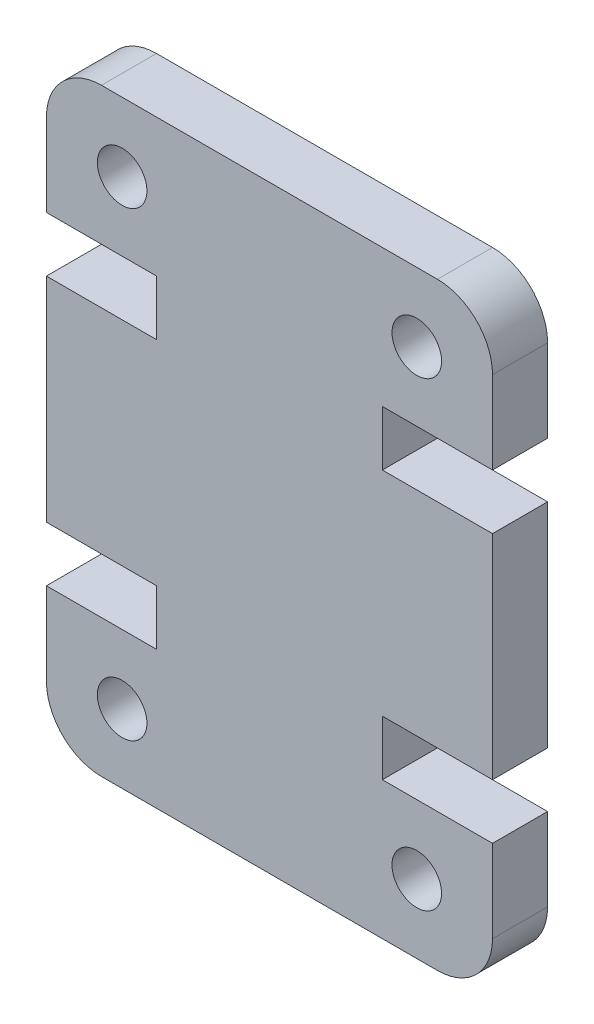
ISO-10303-21;
HEADER;
FILE_DESCRIPTION(('STEP AP214'),'2;1');
FILE_NAME('part.step','',(''),(''),'','','');
FILE_SCHEMA(('AUTOMOTIVE_DESIGN { 1 0 10303 214 1 1 1 1 }'));
ENDSEC;
DATA;
#1=APPLICATION_CONTEXT('core data for automotive mechanical design processes');
#2=APPLICATION_PROTOCOL_DEFINITION('international standard','automotive_design',2000,#1);
#3=PRODUCT_CONTEXT('',#1,'mechanical');
#4=PRODUCT('Part','Part','',(#3));
#5=PRODUCT_RELATED_PRODUCT_CATEGORY('part','',(#4));
#6=PRODUCT_DEFINITION_FORMATION('','',#4);
#7=PRODUCT_DEFINITION_CONTEXT('part definition',#1,'design');
#8=PRODUCT_DEFINITION('design','',#6,#7);
#9=PRODUCT_DEFINITION_SHAPE('','',#8);
#10=(LENGTH_UNIT() NAMED_UNIT(*) SI_UNIT(.MILLI.,.METRE.));
#11=(NAMED_UNIT(*) PLANE_ANGLE_UNIT() SI_UNIT($,.RADIAN.));
#12=(NAMED_UNIT(*) SI_UNIT($,.STERADIAN.) SOLID_ANGLE_UNIT());
#13=UNCERTAINTY_MEASURE_WITH_UNIT(LENGTH_MEASURE(1.E-05),#10,'distance_accuracy_value','');
#14=(GEOMETRIC_REPRESENTATION_CONTEXT(3) GLOBAL_UNCERTAINTY_ASSIGNED_CONTEXT((#13)) GLOBAL_UNIT_ASSIGNED_CONTEXT((#10,
#11,#12)) REPRESENTATION_CONTEXT('',''));
#15=CARTESIAN_POINT('',(0.,0.,0.));
#16=DIRECTION('',(0.,0.,1.));
#17=DIRECTION('',(1.,0.,0.));
#18=AXIS2_PLACEMENT_3D('',#15,#16,#17);
#19=CARTESIAN_POINT('',(14.2,2.,4.));
#20=DIRECTION('',(0.,0.,-1.));
#21=DIRECTION('',(-1.,0.,0.));
#22=AXIS2_PLACEMENT_3D('',#19,#20,#21);
#23=PLANE('',#22);
#24=CARTESIAN_POINT('',(2.75000000000004,19.2399999999998,4.));
#25=DIRECTION('',(0.,0.,1.));
#26=DIRECTION('',(-1.,0.,0.));
#27=AXIS2_PLACEMENT_3D('',#24,#25,#26);
#28=CIRCLE('',#27,0.9);
#29=CARTESIAN_POINT('',(1.85000000000004,19.2399999999998,4.));
#30=VERTEX_POINT('',#29);
#31=EDGE_CURVE('E356',#30,#30,#28,.T.);
#32=ORIENTED_EDGE('',*,*,#31,.F.);
#33=EDGE_LOOP('',(#32));
#34=FACE_BOUND('',#33,.T.);
#35=CARTESIAN_POINT('',(13.45,2.50000000000017,4.));
#36=DIRECTION('',(0.,0.,1.));
#37=DIRECTION('',(-1.,0.,0.));
#38=AXIS2_PLACEMENT_3D('',#35,#36,#37);
#39=CIRCLE('',#38,0.9);
#40=CARTESIAN_POINT('',(12.55,2.50000000000017,4.));
#41=VERTEX_POINT('',#40);
#42=EDGE_CURVE('E362',#41,#41,#39,.T.);
#43=ORIENTED_EDGE('',*,*,#42,.F.);
#44=EDGE_LOOP('',(#43));
#45=FACE_BOUND('',#44,.T.);
#46=CARTESIAN_POINT('',(14.2,2.,4.));
#47=DIRECTION('',(0.,0.,1.));
#48=DIRECTION('',(-1.,0.,0.));
#49=AXIS2_PLACEMENT_3D('',#46,#47,#48);
#50=CIRCLE('',#49,2.);
#51=CARTESIAN_POINT('',(14.2,0.,4.));
#52=VERTEX_POINT('',#51);
#53=CARTESIAN_POINT('',(16.2,2.,4.));
#54=VERTEX_POINT('',#53);
#55=EDGE_CURVE('E365',#52,#54,#50,.T.);
#56=ORIENTED_EDGE('',*,*,#55,.T.);
#57=DIRECTION('',(0.,1.,0.));
#58=VECTOR('',#57,1.);
#59=CARTESIAN_POINT('',(16.2,2.,4.));
#60=LINE('',#59,#58);
#61=CARTESIAN_POINT('',(16.2,4.99999999999945,4.));
#62=VERTEX_POINT('',#61);
#63=EDGE_CURVE('E295',#54,#62,#60,.T.);
#64=ORIENTED_EDGE('',*,*,#63,.T.);
#65=DIRECTION('',(-1.,0.,0.));
#66=VECTOR('',#65,1.);
#67=CARTESIAN_POINT('',(12.2,4.99999999999945,4.));
#68=LINE('',#67,#66);
#69=CARTESIAN_POINT('',(12.2,4.99999999999945,4.));
#70=VERTEX_POINT('',#69);
#71=EDGE_CURVE('E291',#62,#70,#68,.T.);
#72=ORIENTED_EDGE('',*,*,#71,.T.);
#73=DIRECTION('',(0.,1.,0.));
#74=VECTOR('',#73,1.);
#75=CARTESIAN_POINT('',(12.2,6.99999999999945,4.));
#76=LINE('',#75,#74);
#77=CARTESIAN_POINT('',(12.2,6.99999999999945,4.));
#78=VERTEX_POINT('',#77);
#79=EDGE_CURVE('E369',#70,#78,#76,.T.);
#80=ORIENTED_EDGE('',*,*,#79,.T.);
#81=DIRECTION('',(1.,0.,0.));
#82=VECTOR('',#81,1.);
#83=CARTESIAN_POINT('',(16.2,6.99999999999945,4.));
#84=LINE('',#83,#82);
#85=CARTESIAN_POINT('',(16.2,6.99999999999945,4.));
#86=VERTEX_POINT('',#85);
#87=EDGE_CURVE('E371',#78,#86,#84,.T.);
#88=ORIENTED_EDGE('',*,*,#87,.T.);
#89=DIRECTION('',(0.,1.,0.));
#90=VECTOR('',#89,1.);
#91=CARTESIAN_POINT('',(16.2,14.7400000000005,4.));
#92=LINE('',#91,#90);
#93=CARTESIAN_POINT('',(16.2,14.7400000000005,4.));
#94=VERTEX_POINT('',#93);
#95=EDGE_CURVE('E373',#86,#94,#92,.T.);
#96=ORIENTED_EDGE('',*,*,#95,.T.);
#97=DIRECTION('',(-1.,0.,0.));
#98=VECTOR('',#97,1.);
#99=CARTESIAN_POINT('',(16.2,14.7400000000005,4.));
#100=LINE('',#99,#98);
#101=CARTESIAN_POINT('',(12.2,14.7400000000005,4.));
#102=VERTEX_POINT('',#101);
#103=EDGE_CURVE('E375',#94,#102,#100,.T.);
#104=ORIENTED_EDGE('',*,*,#103,.T.);
#105=DIRECTION('',(0.,1.,0.));
#106=VECTOR('',#105,1.);
#107=CARTESIAN_POINT('',(12.2,14.7400000000005,4.));
#108=LINE('',#107,#106);
#109=CARTESIAN_POINT('',(12.2,16.7400000000005,4.));
#110=VERTEX_POINT('',#109);
#111=EDGE_CURVE('E377',#102,#110,#108,.T.);
#112=ORIENTED_EDGE('',*,*,#111,.T.);
#113=DIRECTION('',(1.,0.,0.));
#114=VECTOR('',#113,1.);
#115=CARTESIAN_POINT('',(12.2,16.7400000000005,4.));
#116=LINE('',#115,#114);
#117=CARTESIAN_POINT('',(16.2,16.7400000000005,4.));
#118=VERTEX_POINT('',#117);
#119=EDGE_CURVE('E379',#110,#118,#116,.T.);
#120=ORIENTED_EDGE('',*,*,#119,.T.);
#121=DIRECTION('',(0.,1.,0.));
#122=VECTOR('',#121,1.);
#123=CARTESIAN_POINT('',(16.2,19.74,4.));
#124=LINE('',#123,#122);
#125=CARTESIAN_POINT('',(16.2,19.74,4.));
#126=VERTEX_POINT('',#125);
#127=EDGE_CURVE('E381',#118,#126,#124,.T.);
#128=ORIENTED_EDGE('',*,*,#127,.T.);
#129=CARTESIAN_POINT('',(14.2,19.74,4.));
#130=DIRECTION('',(0.,0.,1.));
#131=DIRECTION('',(1.,0.,0.));
#132=AXIS2_PLACEMENT_3D('',#129,#130,#131);
#133=CIRCLE('',#132,2.);
#134=CARTESIAN_POINT('',(14.2,21.74,4.));
#135=VERTEX_POINT('',#134);
#136=EDGE_CURVE('E383',#126,#135,#133,.T.);
#137=ORIENTED_EDGE('',*,*,#136,.T.);
#138=DIRECTION('',(-1.,0.,0.));
#139=VECTOR('',#138,1.);
#140=CARTESIAN_POINT('',(1.99999999999999,21.74,4.));
#141=LINE('',#140,#139);
#142=CARTESIAN_POINT('',(1.99999999999999,21.74,4.));
#143=VERTEX_POINT('',#142);
#144=EDGE_CURVE('E385',#135,#143,#141,.T.);
#145=ORIENTED_EDGE('',*,*,#144,.T.);
#146=CARTESIAN_POINT('',(2.,19.74,4.));
#147=DIRECTION('',(0.,0.,1.));
#148=DIRECTION('',(-1.,0.,0.));
#149=AXIS2_PLACEMENT_3D('',#146,#147,#148);
#150=CIRCLE('',#149,2.);
#151=CARTESIAN_POINT('',(0.,19.74,4.));
#152=VERTEX_POINT('',#151);
#153=EDGE_CURVE('E387',#143,#152,#150,.T.);
#154=ORIENTED_EDGE('',*,*,#153,.T.);
#155=DIRECTION('',(0.,-1.,0.));
#156=VECTOR('',#155,1.);
#157=CARTESIAN_POINT('',(0.,19.74,4.));
#158=LINE('',#157,#156);
#159=CARTESIAN_POINT('',(0.,16.7400000000005,4.));
#160=VERTEX_POINT('',#159);
#161=EDGE_CURVE('E389',#152,#160,#158,.T.);
#162=ORIENTED_EDGE('',*,*,#161,.T.);
#163=DIRECTION('',(1.,0.,0.));
#164=VECTOR('',#163,1.);
#165=CARTESIAN_POINT('',(4.,16.7400000000005,4.));
#166=LINE('',#165,#164);
#167=CARTESIAN_POINT('',(4.,16.7400000000005,4.));
#168=VERTEX_POINT('',#167);
#169=EDGE_CURVE('E391',#160,#168,#166,.T.);
#170=ORIENTED_EDGE('',*,*,#169,.T.);
#171=DIRECTION('',(0.,-1.,0.));
#172=VECTOR('',#171,1.);
#173=CARTESIAN_POINT('',(4.,14.7400000000005,4.));
#174=LINE('',#173,#172);
#175=CARTESIAN_POINT('',(4.,14.7400000000005,4.));
#176=VERTEX_POINT('',#175);
#177=EDGE_CURVE('E393',#168,#176,#174,.T.);
#178=ORIENTED_EDGE('',*,*,#177,.T.);
#179=DIRECTION('',(-1.,0.,0.));
#180=VECTOR('',#179,1.);
#181=CARTESIAN_POINT('',(0.,14.7400000000005,4.));
#182=LINE('',#181,#180);
#183=CARTESIAN_POINT('',(0.,14.7400000000005,4.));
#184=VERTEX_POINT('',#183);
#185=EDGE_CURVE('E395',#176,#184,#182,.T.);
#186=ORIENTED_EDGE('',*,*,#185,.T.);
#187=DIRECTION('',(0.,-1.,0.));
#188=VECTOR('',#187,1.);
#189=CARTESIAN_POINT('',(0.,14.7400000000005,4.));
#190=LINE('',#189,#188);
#191=CARTESIAN_POINT('',(0.,6.99999999999946,4.));
#192=VERTEX_POINT('',#191);
#193=EDGE_CURVE('E397',#184,#192,#190,.T.);
#194=ORIENTED_EDGE('',*,*,#193,.T.);
#195=DIRECTION('',(1.,0.,0.));
#196=VECTOR('',#195,1.);
#197=CARTESIAN_POINT('',(0.,6.99999999999946,4.));
#198=LINE('',#197,#196);
#199=CARTESIAN_POINT('',(4.00000000000002,6.99999999999946,4.));
#200=VERTEX_POINT('',#199);
#201=EDGE_CURVE('E399',#192,#200,#198,.T.);
#202=ORIENTED_EDGE('',*,*,#201,.T.);
#203=DIRECTION('',(0.,-1.,0.));
#204=VECTOR('',#203,1.);
#205=CARTESIAN_POINT('',(4.00000000000002,6.99999999999946,4.));
#206=LINE('',#205,#204);
#207=CARTESIAN_POINT('',(4.,4.99999999999945,4.));
#208=VERTEX_POINT('',#207);
#209=EDGE_CURVE('E401',#200,#208,#206,.T.);
#210=ORIENTED_EDGE('',*,*,#209,.T.);
#211=DIRECTION('',(-1.,0.,0.));
#212=VECTOR('',#211,1.);
#213=CARTESIAN_POINT('',(4.,4.99999999999945,4.));
#214=LINE('',#213,#212);
#215=CARTESIAN_POINT('',(0.,4.99999999999945,4.));
#216=VERTEX_POINT('',#215);
#217=EDGE_CURVE('E403',#208,#216,#214,.T.);
#218=ORIENTED_EDGE('',*,*,#217,.T.);
#219=DIRECTION('',(0.,-1.,0.));
#220=VECTOR('',#219,1.);
#221=CARTESIAN_POINT('',(0.,2.,4.));
#222=LINE('',#221,#220);
#223=CARTESIAN_POINT('',(0.,2.,4.));
#224=VERTEX_POINT('',#223);
#225=EDGE_CURVE('E405',#216,#224,#222,.T.);
#226=ORIENTED_EDGE('',*,*,#225,.T.);
#227=CARTESIAN_POINT('',(2.00000000000002,2.,4.));
#228=DIRECTION('',(0.,0.,1.));
#229=DIRECTION('',(1.,0.,0.));
#230=AXIS2_PLACEMENT_3D('',#227,#228,#229);
#231=CIRCLE('',#230,2.00000000000001);
#232=CARTESIAN_POINT('',(2.00000000000002,0.,4.));
#233=VERTEX_POINT('',#232);
#234=EDGE_CURVE('E221',#224,#233,#231,.T.);
#235=ORIENTED_EDGE('',*,*,#234,.T.);
#236=DIRECTION('',(1.,0.,0.));
#237=VECTOR('',#236,1.);
#238=CARTESIAN_POINT('',(2.00000000000002,0.,4.));
#239=LINE('',#238,#237);
#240=EDGE_CURVE('E57',#233,#52,#239,.T.);
#241=ORIENTED_EDGE('',*,*,#240,.T.);
#242=EDGE_LOOP('',(#56,#64,#72,#80,#88,#96,#104,#112,#120,#128,#137,#145,#154,#162,#170,#178,
#186,#194,#202,#210,#218,#226,#235,#241));
#243=FACE_BOUND('',#242,.T.);
#244=CARTESIAN_POINT('',(2.75000000000004,2.50000000000017,4.));
#245=DIRECTION('',(0.,0.,1.));
#246=DIRECTION('',(1.,0.,0.));
#247=AXIS2_PLACEMENT_3D('',#244,#245,#246);
#248=CIRCLE('',#247,0.9);
#249=CARTESIAN_POINT('',(3.65000000000004,2.50000000000017,4.));
#250=VERTEX_POINT('',#249);
#251=EDGE_CURVE('E359',#250,#250,#248,.T.);
#252=ORIENTED_EDGE('',*,*,#251,.F.);
#253=EDGE_LOOP('',(#252));
#254=FACE_BOUND('',#253,.T.);
#255=CARTESIAN_POINT('',(13.45,19.2399999999998,4.));
#256=DIRECTION('',(0.,0.,1.));
#257=DIRECTION('',(1.,0.,0.));
#258=AXIS2_PLACEMENT_3D('',#255,#256,#257);
#259=CIRCLE('',#258,0.900000000000001);
#260=CARTESIAN_POINT('',(14.35,19.2399999999998,4.));
#261=VERTEX_POINT('',#260);
#262=EDGE_CURVE('E353',#261,#261,#259,.T.);
#263=ORIENTED_EDGE('',*,*,#262,.F.);
#264=EDGE_LOOP('',(#263));
#265=FACE_BOUND('',#264,.T.);
#266=ADVANCED_FACE('F33',(#34,#45,#243,#254,#265),#23,.F.);
#267=CARTESIAN_POINT('',(14.2,2.,4.));
#268=DIRECTION('',(0.,0.,-1.));
#269=DIRECTION('',(-1.,0.,0.));
#270=AXIS2_PLACEMENT_3D('',#267,#268,#269);
#271=CYLINDRICAL_SURFACE('',#270,2.);
#272=DIRECTION('',(0.,0.,-1.));
#273=VECTOR('',#272,1.);
#274=CARTESIAN_POINT('',(14.2,0.,4.));
#275=LINE('',#274,#273);
#276=CARTESIAN_POINT('',(14.2,0.,2.));
#277=VERTEX_POINT('',#276);
#278=EDGE_CURVE('E226',#52,#277,#275,.T.);
#279=ORIENTED_EDGE('',*,*,#278,.T.);
#280=CARTESIAN_POINT('',(14.2,2.,2.));
#281=DIRECTION('',(0.,0.,1.));
#282=DIRECTION('',(1.,0.,0.));
#283=AXIS2_PLACEMENT_3D('',#280,#281,#282);
#284=CIRCLE('',#283,2.);
#285=CARTESIAN_POINT('',(16.2,2.,2.));
#286=VERTEX_POINT('',#285);
#287=EDGE_CURVE('E49',#277,#286,#284,.T.);
#288=ORIENTED_EDGE('',*,*,#287,.T.);
#289=DIRECTION('',(0.,0.,-1.));
#290=VECTOR('',#289,1.);
#291=CARTESIAN_POINT('',(16.2,2.,4.));
#292=LINE('',#291,#290);
#293=EDGE_CURVE('E11',#54,#286,#292,.T.);
#294=ORIENTED_EDGE('',*,*,#293,.F.);
#295=ORIENTED_EDGE('',*,*,#55,.F.);
#296=EDGE_LOOP('',(#279,#288,#294,#295));
#297=FACE_BOUND('',#296,.T.);
#298=ADVANCED_FACE('F35',(#297),#271,.T.);
#299=CARTESIAN_POINT('',(16.2,2.,4.));
#300=DIRECTION('',(-1.,0.,0.));
#301=DIRECTION('',(0.,-1.,0.));
#302=AXIS2_PLACEMENT_3D('',#299,#300,#301);
#303=PLANE('',#302);
#304=ORIENTED_EDGE('',*,*,#293,.T.);
#305=DIRECTION('',(0.,-1.,0.));
#306=VECTOR('',#305,1.);
#307=CARTESIAN_POINT('',(16.2,0.,2.));
#308=LINE('',#307,#306);
#309=CARTESIAN_POINT('',(16.2,4.99999999999945,2.));
#310=VERTEX_POINT('',#309);
#311=EDGE_CURVE('E296',#310,#286,#308,.T.);
#312=ORIENTED_EDGE('',*,*,#311,.F.);
#313=DIRECTION('',(0.,0.,-1.));
#314=VECTOR('',#313,1.);
#315=CARTESIAN_POINT('',(16.2,4.99999999999945,4.));
#316=LINE('',#315,#314);
#317=EDGE_CURVE('E42',#62,#310,#316,.T.);
#318=ORIENTED_EDGE('',*,*,#317,.F.);
#319=ORIENTED_EDGE('',*,*,#63,.F.);
#320=EDGE_LOOP('',(#304,#312,#318,#319));
#321=FACE_BOUND('',#320,.T.);
#322=ADVANCED_FACE('F294',(#321),#303,.F.);
#323=CARTESIAN_POINT('',(12.2,4.99999999999945,4.));
#324=DIRECTION('',(0.,-1.,0.));
#325=DIRECTION('',(0.,0.,-1.));
#326=AXIS2_PLACEMENT_3D('',#323,#324,#325);
#327=PLANE('',#326);
#328=ORIENTED_EDGE('',*,*,#317,.T.);
#329=DIRECTION('',(-1.,0.,0.));
#330=VECTOR('',#329,1.);
#331=CARTESIAN_POINT('',(12.2,4.99999999999945,2.));
#332=LINE('',#331,#330);
#333=CARTESIAN_POINT('',(12.2,4.99999999999945,2.));
#334=VERTEX_POINT('',#333);
#335=EDGE_CURVE('E290',#310,#334,#332,.T.);
#336=ORIENTED_EDGE('',*,*,#335,.T.);
#337=DIRECTION('',(0.,0.,-1.));
#338=VECTOR('',#337,1.);
#339=CARTESIAN_POINT('',(12.2,4.99999999999945,4.));
#340=LINE('',#339,#338);
#341=EDGE_CURVE('E280',#70,#334,#340,.T.);
#342=ORIENTED_EDGE('',*,*,#341,.F.);
#343=ORIENTED_EDGE('',*,*,#71,.F.);
#344=EDGE_LOOP('',(#328,#336,#342,#343));
#345=FACE_BOUND('',#344,.T.);
#346=ADVANCED_FACE('F288',(#345),#327,.F.);
#347=CARTESIAN_POINT('',(12.2,6.99999999999945,4.));
#348=DIRECTION('',(-1.,0.,0.));
#349=DIRECTION('',(0.,0.,1.));
#350=AXIS2_PLACEMENT_3D('',#347,#348,#349);
#351=PLANE('',#350);
#352=ORIENTED_EDGE('',*,*,#341,.T.);
#353=DIRECTION('',(0.,1.,0.));
#354=VECTOR('',#353,1.);
#355=CARTESIAN_POINT('',(12.2,6.99999999999945,2.));
#356=LINE('',#355,#354);
#357=CARTESIAN_POINT('',(12.2,6.99999999999945,2.));
#358=VERTEX_POINT('',#357);
#359=EDGE_CURVE('E348',#334,#358,#356,.T.);
#360=ORIENTED_EDGE('',*,*,#359,.T.);
#361=DIRECTION('',(0.,0.,-1.));
#362=VECTOR('',#361,1.);
#363=CARTESIAN_POINT('',(12.2,6.99999999999945,4.));
#364=LINE('',#363,#362);
#365=EDGE_CURVE('E277',#78,#358,#364,.T.);
#366=ORIENTED_EDGE('',*,*,#365,.F.);
#367=ORIENTED_EDGE('',*,*,#79,.F.);
#368=EDGE_LOOP('',(#352,#360,#366,#367));
#369=FACE_BOUND('',#368,.T.);
#370=ADVANCED_FACE('F467',(#369),#351,.F.);
#371=CARTESIAN_POINT('',(16.2,6.99999999999945,4.));
#372=DIRECTION('',(0.,1.,0.));
#373=DIRECTION('',(-1.,0.,0.));
#374=AXIS2_PLACEMENT_3D('',#371,#372,#373);
#375=PLANE('',#374);
#376=ORIENTED_EDGE('',*,*,#365,.T.);
#377=DIRECTION('',(1.,0.,0.));
#378=VECTOR('',#377,1.);
#379=CARTESIAN_POINT('',(16.2,6.99999999999945,2.));
#380=LINE('',#379,#378);
#381=CARTESIAN_POINT('',(16.2,6.99999999999945,2.));
#382=VERTEX_POINT('',#381);
#383=EDGE_CURVE('E345',#358,#382,#380,.T.);
#384=ORIENTED_EDGE('',*,*,#383,.T.);
#385=DIRECTION('',(0.,0.,-1.));
#386=VECTOR('',#385,1.);
#387=CARTESIAN_POINT('',(16.2,6.99999999999945,4.));
#388=LINE('',#387,#386);
#389=EDGE_CURVE('E274',#86,#382,#388,.T.);
#390=ORIENTED_EDGE('',*,*,#389,.F.);
#391=ORIENTED_EDGE('',*,*,#87,.F.);
#392=EDGE_LOOP('',(#376,#384,#390,#391));
#393=FACE_BOUND('',#392,.T.);
#394=ADVANCED_FACE('F471',(#393),#375,.F.);
#395=CARTESIAN_POINT('',(16.2,14.7400000000005,4.));
#396=DIRECTION('',(-1.,0.,0.));
#397=DIRECTION('',(0.,0.,1.));
#398=AXIS2_PLACEMENT_3D('',#395,#396,#397);
#399=PLANE('',#398);
#400=ORIENTED_EDGE('',*,*,#389,.T.);
#401=CARTESIAN_POINT('',(16.2,14.7400000000005,2.));
#402=VERTEX_POINT('',#401);
#403=EDGE_CURVE('E298',#402,#382,#308,.T.);
#404=ORIENTED_EDGE('',*,*,#403,.F.);
#405=DIRECTION('',(0.,0.,-1.));
#406=VECTOR('',#405,1.);
#407=CARTESIAN_POINT('',(16.2,14.7400000000005,4.));
#408=LINE('',#407,#406);
#409=EDGE_CURVE('E271',#94,#402,#408,.T.);
#410=ORIENTED_EDGE('',*,*,#409,.F.);
#411=ORIENTED_EDGE('',*,*,#95,.F.);
#412=EDGE_LOOP('',(#400,#404,#410,#411));
#413=FACE_BOUND('',#412,.T.);
#414=ADVANCED_FACE('F478',(#413),#399,.F.);
#415=CARTESIAN_POINT('',(16.2,14.7400000000005,4.));
#416=DIRECTION('',(0.,-1.,0.));
#417=DIRECTION('',(1.,0.,0.));
#418=AXIS2_PLACEMENT_3D('',#415,#416,#417);
#419=PLANE('',#418);
#420=ORIENTED_EDGE('',*,*,#409,.T.);
#421=DIRECTION('',(-1.,0.,0.));
#422=VECTOR('',#421,1.);
#423=CARTESIAN_POINT('',(16.2,14.7400000000005,2.));
#424=LINE('',#423,#422);
#425=CARTESIAN_POINT('',(12.2,14.7400000000005,2.));
#426=VERTEX_POINT('',#425);
#427=EDGE_CURVE('E342',#402,#426,#424,.T.);
#428=ORIENTED_EDGE('',*,*,#427,.T.);
#429=DIRECTION('',(0.,0.,-1.));
#430=VECTOR('',#429,1.);
#431=CARTESIAN_POINT('',(12.2,14.7400000000005,4.));
#432=LINE('',#431,#430);
#433=EDGE_CURVE('E268',#102,#426,#432,.T.);
#434=ORIENTED_EDGE('',*,*,#433,.F.);
#435=ORIENTED_EDGE('',*,*,#103,.F.);
#436=EDGE_LOOP('',(#420,#428,#434,#435));
#437=FACE_BOUND('',#436,.T.);
#438=ADVANCED_FACE('F480',(#437),#419,.F.);
#439=CARTESIAN_POINT('',(12.2,14.7400000000005,4.));
#440=DIRECTION('',(-1.,0.,0.));
#441=DIRECTION('',(0.,0.,1.));
#442=AXIS2_PLACEMENT_3D('',#439,#440,#441);
#443=PLANE('',#442);
#444=ORIENTED_EDGE('',*,*,#433,.T.);
#445=DIRECTION('',(0.,1.,0.));
#446=VECTOR('',#445,1.);
#447=CARTESIAN_POINT('',(12.2,14.7400000000005,2.));
#448=LINE('',#447,#446);
#449=CARTESIAN_POINT('',(12.2,16.7400000000005,2.));
#450=VERTEX_POINT('',#449);
#451=EDGE_CURVE('E339',#426,#450,#448,.T.);
#452=ORIENTED_EDGE('',*,*,#451,.T.);
#453=DIRECTION('',(0.,0.,-1.));
#454=VECTOR('',#453,1.);
#455=CARTESIAN_POINT('',(12.2,16.7400000000005,4.));
#456=LINE('',#455,#454);
#457=EDGE_CURVE('E265',#110,#450,#456,.T.);
#458=ORIENTED_EDGE('',*,*,#457,.F.);
#459=ORIENTED_EDGE('',*,*,#111,.F.);
#460=EDGE_LOOP('',(#444,#452,#458,#459));
#461=FACE_BOUND('',#460,.T.);
#462=ADVANCED_FACE('F484',(#461),#443,.F.);
#463=CARTESIAN_POINT('',(12.2,16.7400000000005,4.));
#464=DIRECTION('',(0.,1.,0.));
#465=DIRECTION('',(0.,0.,1.));
#466=AXIS2_PLACEMENT_3D('',#463,#464,#465);
#467=PLANE('',#466);
#468=ORIENTED_EDGE('',*,*,#457,.T.);
#469=DIRECTION('',(1.,0.,0.));
#470=VECTOR('',#469,1.);
#471=CARTESIAN_POINT('',(12.2,16.7400000000005,2.));
#472=LINE('',#471,#470);
#473=CARTESIAN_POINT('',(16.2,16.7400000000005,2.));
#474=VERTEX_POINT('',#473);
#475=EDGE_CURVE('E337',#450,#474,#472,.T.);
#476=ORIENTED_EDGE('',*,*,#475,.T.);
#477=DIRECTION('',(0.,0.,-1.));
#478=VECTOR('',#477,1.);
#479=CARTESIAN_POINT('',(16.2,16.7400000000005,4.));
#480=LINE('',#479,#478);
#481=EDGE_CURVE('E262',#118,#474,#480,.T.);
#482=ORIENTED_EDGE('',*,*,#481,.F.);
#483=ORIENTED_EDGE('',*,*,#119,.F.);
#484=EDGE_LOOP('',(#468,#476,#482,#483));
#485=FACE_BOUND('',#484,.T.);
#486=ADVANCED_FACE('F490',(#485),#467,.F.);
#487=CARTESIAN_POINT('',(16.2,19.74,4.));
#488=DIRECTION('',(-1.,0.,0.));
#489=DIRECTION('',(0.,-1.,0.));
#490=AXIS2_PLACEMENT_3D('',#487,#488,#489);
#491=PLANE('',#490);
#492=ORIENTED_EDGE('',*,*,#481,.T.);
#493=CARTESIAN_POINT('',(16.2,19.74,2.));
#494=VERTEX_POINT('',#493);
#495=EDGE_CURVE('E300',#494,#474,#308,.T.);
#496=ORIENTED_EDGE('',*,*,#495,.F.);
#497=DIRECTION('',(0.,0.,-1.));
#498=VECTOR('',#497,1.);
#499=CARTESIAN_POINT('',(16.2,19.74,4.));
#500=LINE('',#499,#498);
#501=EDGE_CURVE('E259',#126,#494,#500,.T.);
#502=ORIENTED_EDGE('',*,*,#501,.F.);
#503=ORIENTED_EDGE('',*,*,#127,.F.);
#504=EDGE_LOOP('',(#492,#496,#502,#503));
#505=FACE_BOUND('',#504,.T.);
#506=ADVANCED_FACE('F492',(#505),#491,.F.);
#507=CARTESIAN_POINT('',(14.2,19.74,4.));
#508=DIRECTION('',(0.,0.,-1.));
#509=DIRECTION('',(-1.,0.,0.));
#510=AXIS2_PLACEMENT_3D('',#507,#508,#509);
#511=CYLINDRICAL_SURFACE('',#510,2.);
#512=ORIENTED_EDGE('',*,*,#501,.T.);
#513=CARTESIAN_POINT('',(14.2,19.74,2.));
#514=DIRECTION('',(0.,0.,1.));
#515=DIRECTION('',(1.,0.,0.));
#516=AXIS2_PLACEMENT_3D('',#513,#514,#515);
#517=CIRCLE('',#516,2.);
#518=CARTESIAN_POINT('',(14.2,21.74,2.));
#519=VERTEX_POINT('',#518);
#520=EDGE_CURVE('E334',#494,#519,#517,.T.);
#521=ORIENTED_EDGE('',*,*,#520,.T.);
#522=DIRECTION('',(0.,0.,-1.));
#523=VECTOR('',#522,1.);
#524=CARTESIAN_POINT('',(14.2,21.74,4.));
#525=LINE('',#524,#523);
#526=EDGE_CURVE('E256',#135,#519,#525,.T.);
#527=ORIENTED_EDGE('',*,*,#526,.F.);
#528=ORIENTED_EDGE('',*,*,#136,.F.);
#529=EDGE_LOOP('',(#512,#521,#527,#528));
#530=FACE_BOUND('',#529,.T.);
#531=ADVANCED_FACE('F496',(#530),#511,.T.);
#532=CARTESIAN_POINT('',(1.99999999999999,21.74,4.));
#533=DIRECTION('',(0.,-1.,0.));
#534=DIRECTION('',(0.,0.,-1.));
#535=AXIS2_PLACEMENT_3D('',#532,#533,#534);
#536=PLANE('',#535);
#537=ORIENTED_EDGE('',*,*,#526,.T.);
#538=DIRECTION('',(1.,0.,0.));
#539=VECTOR('',#538,1.);
#540=CARTESIAN_POINT('',(16.2,21.74,2.));
#541=LINE('',#540,#539);
#542=CARTESIAN_POINT('',(2.,21.74,2.));
#543=VERTEX_POINT('',#542);
#544=EDGE_CURVE('E216',#543,#519,#541,.T.);
#545=ORIENTED_EDGE('',*,*,#544,.F.);
#546=DIRECTION('',(0.,0.,-1.));
#547=VECTOR('',#546,1.);
#548=CARTESIAN_POINT('',(1.99999999999999,21.74,4.));
#549=LINE('',#548,#547);
#550=EDGE_CURVE('E253',#143,#543,#549,.T.);
#551=ORIENTED_EDGE('',*,*,#550,.F.);
#552=ORIENTED_EDGE('',*,*,#144,.F.);
#553=EDGE_LOOP('',(#537,#545,#551,#552));
#554=FACE_BOUND('',#553,.T.);
#555=ADVANCED_FACE('F503',(#554),#536,.F.);
#556=CARTESIAN_POINT('',(2.,19.74,4.));
#557=DIRECTION('',(0.,0.,-1.));
#558=DIRECTION('',(-1.,0.,0.));
#559=AXIS2_PLACEMENT_3D('',#556,#557,#558);
#560=CYLINDRICAL_SURFACE('',#559,2.);
#561=ORIENTED_EDGE('',*,*,#550,.T.);
#562=CARTESIAN_POINT('',(2.,19.74,2.));
#563=DIRECTION('',(0.,0.,1.));
#564=DIRECTION('',(1.,0.,0.));
#565=AXIS2_PLACEMENT_3D('',#562,#563,#564);
#566=CIRCLE('',#565,2.);
#567=CARTESIAN_POINT('',(0.,19.74,2.));
#568=VERTEX_POINT('',#567);
#569=EDGE_CURVE('E331',#543,#568,#566,.T.);
#570=ORIENTED_EDGE('',*,*,#569,.T.);
#571=DIRECTION('',(0.,0.,-1.));
#572=VECTOR('',#571,1.);
#573=CARTESIAN_POINT('',(0.,19.74,4.));
#574=LINE('',#573,#572);
#575=EDGE_CURVE('E250',#152,#568,#574,.T.);
#576=ORIENTED_EDGE('',*,*,#575,.F.);
#577=ORIENTED_EDGE('',*,*,#153,.F.);
#578=EDGE_LOOP('',(#561,#570,#576,#577));
#579=FACE_BOUND('',#578,.T.);
#580=ADVANCED_FACE('F505',(#579),#560,.T.);
#581=CARTESIAN_POINT('',(0.,19.74,4.));
#582=DIRECTION('',(1.,0.,0.));
#583=DIRECTION('',(0.,1.,0.));
#584=AXIS2_PLACEMENT_3D('',#581,#582,#583);
#585=PLANE('',#584);
#586=ORIENTED_EDGE('',*,*,#575,.T.);
#587=DIRECTION('',(0.,1.,0.));
#588=VECTOR('',#587,1.);
#589=CARTESIAN_POINT('',(0.,21.74,2.));
#590=LINE('',#589,#588);
#591=CARTESIAN_POINT('',(0.,16.7400000000005,2.));
#592=VERTEX_POINT('',#591);
#593=EDGE_CURVE('E219',#592,#568,#590,.T.);
#594=ORIENTED_EDGE('',*,*,#593,.F.);
#595=DIRECTION('',(0.,0.,-1.));
#596=VECTOR('',#595,1.);
#597=CARTESIAN_POINT('',(0.,16.7400000000005,4.));
#598=LINE('',#597,#596);
#599=EDGE_CURVE('E247',#160,#592,#598,.T.);
#600=ORIENTED_EDGE('',*,*,#599,.F.);
#601=ORIENTED_EDGE('',*,*,#161,.F.);
#602=EDGE_LOOP('',(#586,#594,#600,#601));
#603=FACE_BOUND('',#602,.T.);
#604=ADVANCED_FACE('F510',(#603),#585,.F.);
#605=CARTESIAN_POINT('',(4.,16.7400000000005,4.));
#606=DIRECTION('',(0.,1.,0.));
#607=DIRECTION('',(-1.,0.,0.));
#608=AXIS2_PLACEMENT_3D('',#605,#606,#607);
#609=PLANE('',#608);
#610=ORIENTED_EDGE('',*,*,#599,.T.);
#611=DIRECTION('',(1.,0.,0.));
#612=VECTOR('',#611,1.);
#613=CARTESIAN_POINT('',(4.,16.7400000000005,2.));
#614=LINE('',#613,#612);
#615=CARTESIAN_POINT('',(4.,16.7400000000005,2.));
#616=VERTEX_POINT('',#615);
#617=EDGE_CURVE('E328',#592,#616,#614,.T.);
#618=ORIENTED_EDGE('',*,*,#617,.T.);
#619=DIRECTION('',(0.,0.,-1.));
#620=VECTOR('',#619,1.);
#621=CARTESIAN_POINT('',(4.,16.7400000000005,4.));
#622=LINE('',#621,#620);
#623=EDGE_CURVE('E244',#168,#616,#622,.T.);
#624=ORIENTED_EDGE('',*,*,#623,.F.);
#625=ORIENTED_EDGE('',*,*,#169,.F.);
#626=EDGE_LOOP('',(#610,#618,#624,#625));
#627=FACE_BOUND('',#626,.T.);
#628=ADVANCED_FACE('F516',(#627),#609,.F.);
#629=CARTESIAN_POINT('',(4.,14.7400000000005,4.));
#630=DIRECTION('',(1.,0.,0.));
#631=DIRECTION('',(0.,0.,-1.));
#632=AXIS2_PLACEMENT_3D('',#629,#630,#631);
#633=PLANE('',#632);
#634=ORIENTED_EDGE('',*,*,#623,.T.);
#635=DIRECTION('',(0.,-1.,0.));
#636=VECTOR('',#635,1.);
#637=CARTESIAN_POINT('',(4.,14.7400000000005,2.));
#638=LINE('',#637,#636);
#639=CARTESIAN_POINT('',(4.,14.7400000000005,2.));
#640=VERTEX_POINT('',#639);
#641=EDGE_CURVE('E325',#616,#640,#638,.T.);
#642=ORIENTED_EDGE('',*,*,#641,.T.);
#643=DIRECTION('',(0.,0.,-1.));
#644=VECTOR('',#643,1.);
#645=CARTESIAN_POINT('',(4.,14.7400000000005,4.));
#646=LINE('',#645,#644);
#647=EDGE_CURVE('E241',#176,#640,#646,.T.);
#648=ORIENTED_EDGE('',*,*,#647,.F.);
#649=ORIENTED_EDGE('',*,*,#177,.F.);
#650=EDGE_LOOP('',(#634,#642,#648,#649));
#651=FACE_BOUND('',#650,.T.);
#652=ADVANCED_FACE('F518',(#651),#633,.F.);
#653=CARTESIAN_POINT('',(0.,14.7400000000005,4.));
#654=DIRECTION('',(0.,-1.,0.));
#655=DIRECTION('',(1.,0.,0.));
#656=AXIS2_PLACEMENT_3D('',#653,#654,#655);
#657=PLANE('',#656);
#658=ORIENTED_EDGE('',*,*,#647,.T.);
#659=DIRECTION('',(-1.,0.,0.));
#660=VECTOR('',#659,1.);
#661=CARTESIAN_POINT('',(0.,14.7400000000005,2.));
#662=LINE('',#661,#660);
#663=CARTESIAN_POINT('',(0.,14.7400000000005,2.));
#664=VERTEX_POINT('',#663);
#665=EDGE_CURVE('E322',#640,#664,#662,.T.);
#666=ORIENTED_EDGE('',*,*,#665,.T.);
#667=DIRECTION('',(0.,0.,-1.));
#668=VECTOR('',#667,1.);
#669=CARTESIAN_POINT('',(0.,14.7400000000005,4.));
#670=LINE('',#669,#668);
#671=EDGE_CURVE('E238',#184,#664,#670,.T.);
#672=ORIENTED_EDGE('',*,*,#671,.F.);
#673=ORIENTED_EDGE('',*,*,#185,.F.);
#674=EDGE_LOOP('',(#658,#666,#672,#673));
#675=FACE_BOUND('',#674,.T.);
#676=ADVANCED_FACE('F522',(#675),#657,.F.);
#677=CARTESIAN_POINT('',(0.,14.7400000000005,4.));
#678=DIRECTION('',(1.,0.,0.));
#679=DIRECTION('',(0.,1.,0.));
#680=AXIS2_PLACEMENT_3D('',#677,#678,#679);
#681=PLANE('',#680);
#682=ORIENTED_EDGE('',*,*,#671,.T.);
#683=CARTESIAN_POINT('',(0.,6.99999999999946,2.));
#684=VERTEX_POINT('',#683);
#685=EDGE_CURVE('E217',#684,#664,#590,.T.);
#686=ORIENTED_EDGE('',*,*,#685,.F.);
#687=DIRECTION('',(0.,0.,-1.));
#688=VECTOR('',#687,1.);
#689=CARTESIAN_POINT('',(0.,6.99999999999946,4.));
#690=LINE('',#689,#688);
#691=EDGE_CURVE('E235',#192,#684,#690,.T.);
#692=ORIENTED_EDGE('',*,*,#691,.F.);
#693=ORIENTED_EDGE('',*,*,#193,.F.);
#694=EDGE_LOOP('',(#682,#686,#692,#693));
#695=FACE_BOUND('',#694,.T.);
#696=ADVANCED_FACE('F529',(#695),#681,.F.);
#697=CARTESIAN_POINT('',(0.,6.99999999999946,4.));
#698=DIRECTION('',(0.,1.,0.));
#699=DIRECTION('',(0.,0.,1.));
#700=AXIS2_PLACEMENT_3D('',#697,#698,#699);
#701=PLANE('',#700);
#702=ORIENTED_EDGE('',*,*,#691,.T.);
#703=DIRECTION('',(1.,0.,0.));
#704=VECTOR('',#703,1.);
#705=CARTESIAN_POINT('',(0.,6.99999999999946,2.));
#706=LINE('',#705,#704);
#707=CARTESIAN_POINT('',(4.00000000000002,6.99999999999946,2.));
#708=VERTEX_POINT('',#707);
#709=EDGE_CURVE('E319',#684,#708,#706,.T.);
#710=ORIENTED_EDGE('',*,*,#709,.T.);
#711=DIRECTION('',(0.,0.,-1.));
#712=VECTOR('',#711,1.);
#713=CARTESIAN_POINT('',(4.00000000000002,6.99999999999946,4.));
#714=LINE('',#713,#712);
#715=EDGE_CURVE('E232',#200,#708,#714,.T.);
#716=ORIENTED_EDGE('',*,*,#715,.F.);
#717=ORIENTED_EDGE('',*,*,#201,.F.);
#718=EDGE_LOOP('',(#702,#710,#716,#717));
#719=FACE_BOUND('',#718,.T.);
#720=ADVANCED_FACE('F531',(#719),#701,.F.);
#721=CARTESIAN_POINT('',(4.00000000000002,6.99999999999946,4.));
#722=DIRECTION('',(1.,0.,0.));
#723=DIRECTION('',(0.,1.,0.));
#724=AXIS2_PLACEMENT_3D('',#721,#722,#723);
#725=PLANE('',#724);
#726=ORIENTED_EDGE('',*,*,#715,.T.);
#727=DIRECTION('',(0.,-1.,0.));
#728=VECTOR('',#727,1.);
#729=CARTESIAN_POINT('',(4.00000000000002,6.99999999999946,2.));
#730=LINE('',#729,#728);
#731=CARTESIAN_POINT('',(4.,4.99999999999945,2.));
#732=VERTEX_POINT('',#731);
#733=EDGE_CURVE('E316',#708,#732,#730,.T.);
#734=ORIENTED_EDGE('',*,*,#733,.T.);
#735=DIRECTION('',(0.,0.,-1.));
#736=VECTOR('',#735,1.);
#737=CARTESIAN_POINT('',(4.,4.99999999999945,4.));
#738=LINE('',#737,#736);
#739=EDGE_CURVE('E224',#208,#732,#738,.T.);
#740=ORIENTED_EDGE('',*,*,#739,.F.);
#741=ORIENTED_EDGE('',*,*,#209,.F.);
#742=EDGE_LOOP('',(#726,#734,#740,#741));
#743=FACE_BOUND('',#742,.T.);
#744=ADVANCED_FACE('F535',(#743),#725,.F.);
#745=CARTESIAN_POINT('',(4.,4.99999999999945,4.));
#746=DIRECTION('',(0.,-1.,0.));
#747=DIRECTION('',(0.,0.,-1.));
#748=AXIS2_PLACEMENT_3D('',#745,#746,#747);
#749=PLANE('',#748);
#750=ORIENTED_EDGE('',*,*,#739,.T.);
#751=DIRECTION('',(-1.,0.,0.));
#752=VECTOR('',#751,1.);
#753=CARTESIAN_POINT('',(4.,4.99999999999945,2.));
#754=LINE('',#753,#752);
#755=CARTESIAN_POINT('',(0.,4.99999999999946,2.));
#756=VERTEX_POINT('',#755);
#757=EDGE_CURVE('E204',#732,#756,#754,.T.);
#758=ORIENTED_EDGE('',*,*,#757,.T.);
#759=DIRECTION('',(0.,0.,-1.));
#760=VECTOR('',#759,1.);
#761=CARTESIAN_POINT('',(0.,4.99999999999945,4.));
#762=LINE('',#761,#760);
#763=EDGE_CURVE('E215',#216,#756,#762,.T.);
#764=ORIENTED_EDGE('',*,*,#763,.F.);
#765=ORIENTED_EDGE('',*,*,#217,.F.);
#766=EDGE_LOOP('',(#750,#758,#764,#765));
#767=FACE_BOUND('',#766,.T.);
#768=ADVANCED_FACE('F538',(#767),#749,.F.);
#769=CARTESIAN_POINT('',(0.,2.,4.));
#770=DIRECTION('',(1.,0.,0.));
#771=DIRECTION('',(0.,0.,-1.));
#772=AXIS2_PLACEMENT_3D('',#769,#770,#771);
#773=PLANE('',#772);
#774=ORIENTED_EDGE('',*,*,#763,.T.);
#775=CARTESIAN_POINT('',(0.,2.,2.));
#776=VERTEX_POINT('',#775);
#777=EDGE_CURVE('E197',#776,#756,#590,.T.);
#778=ORIENTED_EDGE('',*,*,#777,.F.);
#779=DIRECTION('',(0.,0.,-1.));
#780=VECTOR('',#779,1.);
#781=CARTESIAN_POINT('',(0.,2.,4.));
#782=LINE('',#781,#780);
#783=EDGE_CURVE('E212',#224,#776,#782,.T.);
#784=ORIENTED_EDGE('',*,*,#783,.F.);
#785=ORIENTED_EDGE('',*,*,#225,.F.);
#786=EDGE_LOOP('',(#774,#778,#784,#785));
#787=FACE_BOUND('',#786,.T.);
#788=ADVANCED_FACE('F210',(#787),#773,.F.);
#789=CARTESIAN_POINT('',(2.00000000000002,2.,4.));
#790=DIRECTION('',(0.,0.,-1.));
#791=DIRECTION('',(-1.,0.,0.));
#792=AXIS2_PLACEMENT_3D('',#789,#790,#791);
#793=CYLINDRICAL_SURFACE('',#792,2.00000000000001);
#794=ORIENTED_EDGE('',*,*,#783,.T.);
#795=CARTESIAN_POINT('',(2.00000000000002,2.,2.));
#796=DIRECTION('',(0.,0.,1.));
#797=DIRECTION('',(1.,0.,0.));
#798=AXIS2_PLACEMENT_3D('',#795,#796,#797);
#799=CIRCLE('',#798,2.00000000000001);
#800=CARTESIAN_POINT('',(2.00000000000002,0.,2.));
#801=VERTEX_POINT('',#800);
#802=EDGE_CURVE('E194',#776,#801,#799,.T.);
#803=ORIENTED_EDGE('',*,*,#802,.T.);
#804=DIRECTION('',(0.,0.,-1.));
#805=VECTOR('',#804,1.);
#806=CARTESIAN_POINT('',(2.00000000000002,0.,4.));
#807=LINE('',#806,#805);
#808=EDGE_CURVE('E222',#233,#801,#807,.T.);
#809=ORIENTED_EDGE('',*,*,#808,.F.);
#810=ORIENTED_EDGE('',*,*,#234,.F.);
#811=EDGE_LOOP('',(#794,#803,#809,#810));
#812=FACE_BOUND('',#811,.T.);
#813=ADVANCED_FACE('F220',(#812),#793,.T.);
#814=CARTESIAN_POINT('',(2.00000000000002,0.,4.));
#815=DIRECTION('',(0.,1.,0.));
#816=DIRECTION('',(-1.,0.,0.));
#817=AXIS2_PLACEMENT_3D('',#814,#815,#816);
#818=PLANE('',#817);
#819=ORIENTED_EDGE('',*,*,#808,.T.);
#820=DIRECTION('',(-1.,0.,0.));
#821=VECTOR('',#820,1.);
#822=CARTESIAN_POINT('',(0.,0.,2.));
#823=LINE('',#822,#821);
#824=EDGE_CURVE('E199',#277,#801,#823,.T.);
#825=ORIENTED_EDGE('',*,*,#824,.F.);
#826=ORIENTED_EDGE('',*,*,#278,.F.);
#827=ORIENTED_EDGE('',*,*,#240,.F.);
#828=EDGE_LOOP('',(#819,#825,#826,#827));
#829=FACE_BOUND('',#828,.T.);
#830=ADVANCED_FACE('F412',(#829),#818,.F.);
#831=CARTESIAN_POINT('',(13.45,2.50000000000017,4.));
#832=DIRECTION('',(0.,0.,-1.));
#833=DIRECTION('',(-1.,0.,0.));
#834=AXIS2_PLACEMENT_3D('',#831,#832,#833);
#835=CYLINDRICAL_SURFACE('',#834,0.9);
#836=CARTESIAN_POINT('',(13.45,2.50000000000017,2.));
#837=DIRECTION('',(0.,0.,1.));
#838=DIRECTION('',(1.,0.,0.));
#839=AXIS2_PLACEMENT_3D('',#836,#837,#838);
#840=CIRCLE('',#839,0.9);
#841=CARTESIAN_POINT('',(14.35,2.50000000000017,2.));
#842=VERTEX_POINT('',#841);
#843=EDGE_CURVE('E205',#842,#842,#840,.T.);
#844=ORIENTED_EDGE('',*,*,#843,.F.);
#845=EDGE_LOOP('',(#844));
#846=FACE_BOUND('',#845,.T.);
#847=ORIENTED_EDGE('',*,*,#42,.T.);
#848=EDGE_LOOP('',(#847));
#849=FACE_BOUND('',#848,.T.);
#850=ADVANCED_FACE('F414',(#846,#849),#835,.F.);
#851=CARTESIAN_POINT('',(2.75000000000004,2.50000000000017,4.));
#852=DIRECTION('',(0.,0.,-1.));
#853=DIRECTION('',(-1.,0.,0.));
#854=AXIS2_PLACEMENT_3D('',#851,#852,#853);
#855=CYLINDRICAL_SURFACE('',#854,0.9);
#856=CARTESIAN_POINT('',(2.75000000000004,2.50000000000017,2.));
#857=DIRECTION('',(0.,0.,1.));
#858=DIRECTION('',(1.,0.,0.));
#859=AXIS2_PLACEMENT_3D('',#856,#857,#858);
#860=CIRCLE('',#859,0.9);
#861=CARTESIAN_POINT('',(3.65000000000004,2.50000000000017,2.));
#862=VERTEX_POINT('',#861);
#863=EDGE_CURVE('E310',#862,#862,#860,.T.);
#864=ORIENTED_EDGE('',*,*,#863,.F.);
#865=EDGE_LOOP('',(#864));
#866=FACE_BOUND('',#865,.T.);
#867=ORIENTED_EDGE('',*,*,#251,.T.);
#868=EDGE_LOOP('',(#867));
#869=FACE_BOUND('',#868,.T.);
#870=ADVANCED_FACE('F420',(#866,#869),#855,.F.);
#871=CARTESIAN_POINT('',(2.75000000000004,19.2399999999998,4.));
#872=DIRECTION('',(0.,0.,-1.));
#873=DIRECTION('',(-1.,0.,0.));
#874=AXIS2_PLACEMENT_3D('',#871,#872,#873);
#875=CYLINDRICAL_SURFACE('',#874,0.9);
#876=CARTESIAN_POINT('',(2.75000000000004,19.2399999999998,2.));
#877=DIRECTION('',(0.,0.,1.));
#878=DIRECTION('',(1.,0.,0.));
#879=AXIS2_PLACEMENT_3D('',#876,#877,#878);
#880=CIRCLE('',#879,0.9);
#881=CARTESIAN_POINT('',(3.65000000000004,19.2399999999998,2.));
#882=VERTEX_POINT('',#881);
#883=EDGE_CURVE('E306',#882,#882,#880,.T.);
#884=ORIENTED_EDGE('',*,*,#883,.F.);
#885=EDGE_LOOP('',(#884));
#886=FACE_BOUND('',#885,.T.);
#887=ORIENTED_EDGE('',*,*,#31,.T.);
#888=EDGE_LOOP('',(#887));
#889=FACE_BOUND('',#888,.T.);
#890=ADVANCED_FACE('F435',(#886,#889),#875,.F.);
#891=CARTESIAN_POINT('',(13.45,19.2399999999998,4.));
#892=DIRECTION('',(0.,0.,-1.));
#893=DIRECTION('',(-1.,0.,0.));
#894=AXIS2_PLACEMENT_3D('',#891,#892,#893);
#895=CYLINDRICAL_SURFACE('',#894,0.900000000000001);
#896=CARTESIAN_POINT('',(13.45,19.2399999999998,2.));
#897=DIRECTION('',(0.,0.,1.));
#898=DIRECTION('',(1.,0.,0.));
#899=AXIS2_PLACEMENT_3D('',#896,#897,#898);
#900=CIRCLE('',#899,0.900000000000001);
#901=CARTESIAN_POINT('',(14.35,19.2399999999998,2.));
#902=VERTEX_POINT('',#901);
#903=EDGE_CURVE('E37',#902,#902,#900,.T.);
#904=ORIENTED_EDGE('',*,*,#903,.F.);
#905=EDGE_LOOP('',(#904));
#906=FACE_BOUND('',#905,.T.);
#907=ORIENTED_EDGE('',*,*,#262,.T.);
#908=EDGE_LOOP('',(#907));
#909=FACE_BOUND('',#908,.T.);
#910=ADVANCED_FACE('F439',(#906,#909),#895,.F.);
#911=CARTESIAN_POINT('',(0.,0.,2.));
#912=DIRECTION('',(0.,0.,1.));
#913=DIRECTION('',(1.,0.,0.));
#914=AXIS2_PLACEMENT_3D('',#911,#912,#913);
#915=PLANE('',#914);
#916=ORIENTED_EDGE('',*,*,#843,.T.);
#917=EDGE_LOOP('',(#916));
#918=FACE_BOUND('',#917,.T.);
#919=ORIENTED_EDGE('',*,*,#863,.T.);
#920=EDGE_LOOP('',(#919));
#921=FACE_BOUND('',#920,.T.);
#922=ORIENTED_EDGE('',*,*,#883,.T.);
#923=EDGE_LOOP('',(#922));
#924=FACE_BOUND('',#923,.T.);
#925=ORIENTED_EDGE('',*,*,#903,.T.);
#926=EDGE_LOOP('',(#925));
#927=FACE_BOUND('',#926,.T.);
#928=ORIENTED_EDGE('',*,*,#824,.T.);
#929=ORIENTED_EDGE('',*,*,#802,.F.);
#930=ORIENTED_EDGE('',*,*,#777,.T.);
#931=ORIENTED_EDGE('',*,*,#757,.F.);
#932=ORIENTED_EDGE('',*,*,#733,.F.);
#933=ORIENTED_EDGE('',*,*,#709,.F.);
#934=ORIENTED_EDGE('',*,*,#685,.T.);
#935=ORIENTED_EDGE('',*,*,#665,.F.);
#936=ORIENTED_EDGE('',*,*,#641,.F.);
#937=ORIENTED_EDGE('',*,*,#617,.F.);
#938=ORIENTED_EDGE('',*,*,#593,.T.);
#939=ORIENTED_EDGE('',*,*,#569,.F.);
#940=ORIENTED_EDGE('',*,*,#544,.T.);
#941=ORIENTED_EDGE('',*,*,#520,.F.);
#942=ORIENTED_EDGE('',*,*,#495,.T.);
#943=ORIENTED_EDGE('',*,*,#475,.F.);
#944=ORIENTED_EDGE('',*,*,#451,.F.);
#945=ORIENTED_EDGE('',*,*,#427,.F.);
#946=ORIENTED_EDGE('',*,*,#403,.T.);
#947=ORIENTED_EDGE('',*,*,#383,.F.);
#948=ORIENTED_EDGE('',*,*,#359,.F.);
#949=ORIENTED_EDGE('',*,*,#335,.F.);
#950=ORIENTED_EDGE('',*,*,#311,.T.);
#951=ORIENTED_EDGE('',*,*,#287,.F.);
#952=EDGE_LOOP('',(#928,#929,#930,#931,#932,#933,#934,#935,#936,#937,#938,#939,#940,#941,#942,
#943,#944,#945,#946,#947,#948,#949,#950,#951));
#953=FACE_BOUND('',#952,.T.);
#954=ADVANCED_FACE('F196',(#918,#921,#924,#927,#953),#915,.F.);
#955=CLOSED_SHELL('',(#266,#298,#322,#346,#370,#394,#414,#438,#462,#486,#506,#531,#555,#580,
#604,#628,#652,#676,#696,#720,#744,#768,#788,#813,#830,#850,#870,#890,#910,#954));
#956=MANIFOLD_SOLID_BREP('B2',#955);
#957=ADVANCED_BREP_SHAPE_REPRESENTATION('',(#18,#956),#14);
#958=SHAPE_DEFINITION_REPRESENTATION(#9,#957);
ENDSEC;
END-ISO-10303-21;
